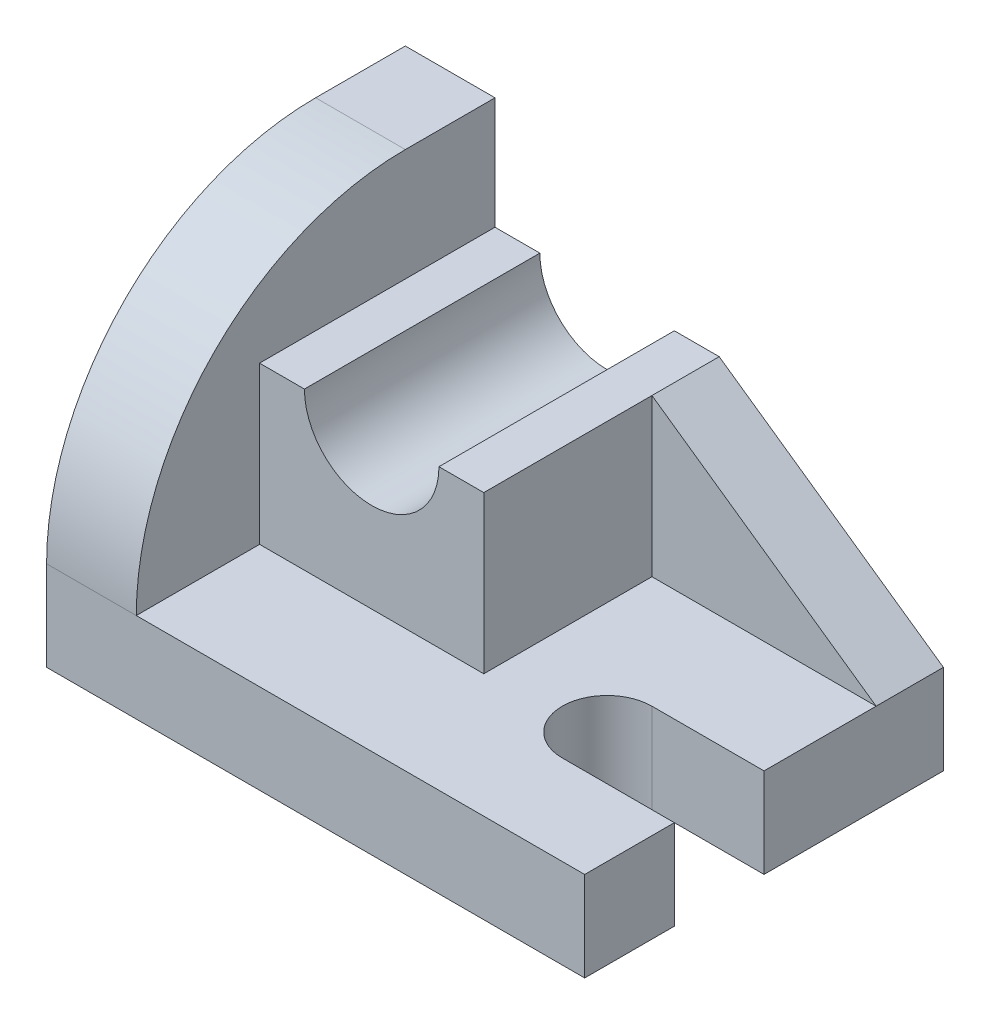
ISO-10303-21;
HEADER;
FILE_DESCRIPTION(('STEP AP214'),'2;1');
FILE_NAME('part.step','',(''),(''),'','','');
FILE_SCHEMA(('AUTOMOTIVE_DESIGN { 1 0 10303 214 1 1 1 1 }'));
ENDSEC;
DATA;
#1=APPLICATION_CONTEXT('core data for automotive mechanical design processes');
#2=APPLICATION_PROTOCOL_DEFINITION('international standard','automotive_design',2000,#1);
#3=PRODUCT_CONTEXT('',#1,'mechanical');
#4=PRODUCT('Part','Part','',(#3));
#5=PRODUCT_RELATED_PRODUCT_CATEGORY('part','',(#4));
#6=PRODUCT_DEFINITION_FORMATION('','',#4);
#7=PRODUCT_DEFINITION_CONTEXT('part definition',#1,'design');
#8=PRODUCT_DEFINITION('design','',#6,#7);
#9=PRODUCT_DEFINITION_SHAPE('','',#8);
#10=(LENGTH_UNIT() NAMED_UNIT(*) SI_UNIT(.MILLI.,.METRE.));
#11=(NAMED_UNIT(*) PLANE_ANGLE_UNIT() SI_UNIT($,.RADIAN.));
#12=(NAMED_UNIT(*) SI_UNIT($,.STERADIAN.) SOLID_ANGLE_UNIT());
#13=UNCERTAINTY_MEASURE_WITH_UNIT(LENGTH_MEASURE(1.E-05),#10,'distance_accuracy_value','');
#14=(GEOMETRIC_REPRESENTATION_CONTEXT(3) GLOBAL_UNCERTAINTY_ASSIGNED_CONTEXT((#13)) GLOBAL_UNIT_ASSIGNED_CONTEXT((#10,
#11,#12)) REPRESENTATION_CONTEXT('',''));
#15=CARTESIAN_POINT('',(0.,0.,0.));
#16=DIRECTION('',(0.,0.,1.));
#17=DIRECTION('',(1.,0.,0.));
#18=AXIS2_PLACEMENT_3D('',#15,#16,#17);
#19=CARTESIAN_POINT('',(0.,44.,0.));
#20=DIRECTION('',(0.,1.,0.));
#21=DIRECTION('',(0.,0.,1.));
#22=AXIS2_PLACEMENT_3D('',#19,#20,#21);
#23=PLANE('',#22);
#24=DIRECTION('',(0.,0.,1.));
#25=VECTOR('',#24,1.);
#26=CARTESIAN_POINT('',(24.,44.,-64.001));
#27=LINE('',#26,#25);
#28=CARTESIAN_POINT('',(24.,44.,-22.));
#29=VERTEX_POINT('',#28);
#30=CARTESIAN_POINT('',(24.,44.,-64.));
#31=VERTEX_POINT('',#30);
#32=EDGE_CURVE('E366',#29,#31,#27,.F.);
#33=ORIENTED_EDGE('',*,*,#32,.T.);
#34=DIRECTION('',(-1.,0.,0.));
#35=VECTOR('',#34,1.);
#36=CARTESIAN_POINT('',(16.,44.,-64.));
#37=LINE('',#36,#35);
#38=CARTESIAN_POINT('',(16.,44.,-64.));
#39=VERTEX_POINT('',#38);
#40=EDGE_CURVE('E194',#31,#39,#37,.T.);
#41=ORIENTED_EDGE('',*,*,#40,.T.);
#42=DIRECTION('',(0.,0.,1.));
#43=VECTOR('',#42,1.);
#44=CARTESIAN_POINT('',(16.,44.,-64.));
#45=LINE('',#44,#43);
#46=CARTESIAN_POINT('',(16.,44.,-22.));
#47=VERTEX_POINT('',#46);
#48=EDGE_CURVE('E213',#39,#47,#45,.T.);
#49=ORIENTED_EDGE('',*,*,#48,.T.);
#50=DIRECTION('',(1.,0.,0.));
#51=VECTOR('',#50,1.);
#52=CARTESIAN_POINT('',(16.,44.,-22.));
#53=LINE('',#52,#51);
#54=EDGE_CURVE('E195',#47,#29,#53,.T.);
#55=ORIENTED_EDGE('',*,*,#54,.T.);
#56=EDGE_LOOP('',(#33,#41,#49,#55));
#57=FACE_BOUND('',#56,.T.);
#58=ADVANCED_FACE('F43',(#57),#23,.T.);
#59=CARTESIAN_POINT('',(0.,16.,0.));
#60=DIRECTION('',(0.,-1.,0.));
#61=DIRECTION('',(0.,0.,-1.));
#62=AXIS2_PLACEMENT_3D('',#59,#60,#61);
#63=PLANE('',#62);
#64=DIRECTION('',(0.,0.,-1.));
#65=VECTOR('',#64,1.);
#66=CARTESIAN_POINT('',(96.,16.,0.));
#67=LINE('',#66,#65);
#68=CARTESIAN_POINT('',(96.,16.,-32.));
#69=VERTEX_POINT('',#68);
#70=CARTESIAN_POINT('',(96.,16.,-52.));
#71=VERTEX_POINT('',#70);
#72=EDGE_CURVE('E291',#69,#71,#67,.T.);
#73=ORIENTED_EDGE('',*,*,#72,.T.);
#74=DIRECTION('',(-1.,0.,0.));
#75=VECTOR('',#74,1.);
#76=CARTESIAN_POINT('',(56.,16.,-52.));
#77=LINE('',#76,#75);
#78=CARTESIAN_POINT('',(56.,16.,-52.));
#79=VERTEX_POINT('',#78);
#80=EDGE_CURVE('E173',#71,#79,#77,.T.);
#81=ORIENTED_EDGE('',*,*,#80,.T.);
#82=DIRECTION('',(0.,0.,-1.));
#83=VECTOR('',#82,1.);
#84=CARTESIAN_POINT('',(56.,16.,-64.));
#85=LINE('',#84,#83);
#86=CARTESIAN_POINT('',(56.,16.,-22.));
#87=VERTEX_POINT('',#86);
#88=EDGE_CURVE('E67',#87,#79,#85,.T.);
#89=ORIENTED_EDGE('',*,*,#88,.F.);
#90=DIRECTION('',(1.,0.,0.));
#91=VECTOR('',#90,1.);
#92=CARTESIAN_POINT('',(16.,16.,-22.));
#93=LINE('',#92,#91);
#94=CARTESIAN_POINT('',(16.,16.,-22.));
#95=VERTEX_POINT('',#94);
#96=EDGE_CURVE('E207',#95,#87,#93,.T.);
#97=ORIENTED_EDGE('',*,*,#96,.F.);
#98=DIRECTION('',(0.,0.,1.));
#99=VECTOR('',#98,1.);
#100=CARTESIAN_POINT('',(16.,16.,0.));
#101=LINE('',#100,#99);
#102=CARTESIAN_POINT('',(16.,16.,0.));
#103=VERTEX_POINT('',#102);
#104=EDGE_CURVE('E245',#95,#103,#101,.T.);
#105=ORIENTED_EDGE('',*,*,#104,.T.);
#106=DIRECTION('',(1.,0.,0.));
#107=VECTOR('',#106,1.);
#108=CARTESIAN_POINT('',(0.,16.,0.));
#109=LINE('',#108,#107);
#110=CARTESIAN_POINT('',(96.,16.,0.));
#111=VERTEX_POINT('',#110);
#112=EDGE_CURVE('E292',#103,#111,#109,.T.);
#113=ORIENTED_EDGE('',*,*,#112,.T.);
#114=CARTESIAN_POINT('',(96.,16.,-16.));
#115=VERTEX_POINT('',#114);
#116=EDGE_CURVE('E293',#111,#115,#67,.T.);
#117=ORIENTED_EDGE('',*,*,#116,.T.);
#118=DIRECTION('',(1.,0.,0.));
#119=VECTOR('',#118,1.);
#120=CARTESIAN_POINT('',(96.,16.,-16.));
#121=LINE('',#120,#119);
#122=CARTESIAN_POINT('',(76.,16.,-16.));
#123=VERTEX_POINT('',#122);
#124=EDGE_CURVE('E256',#123,#115,#121,.T.);
#125=ORIENTED_EDGE('',*,*,#124,.F.);
#126=CARTESIAN_POINT('',(76.,16.,-24.));
#127=DIRECTION('',(0.,1.,0.));
#128=DIRECTION('',(0.,0.,1.));
#129=AXIS2_PLACEMENT_3D('',#126,#127,#128);
#130=CIRCLE('',#129,7.99999999999999);
#131=CARTESIAN_POINT('',(76.,16.,-32.));
#132=VERTEX_POINT('',#131);
#133=EDGE_CURVE('E268',#132,#123,#130,.T.);
#134=ORIENTED_EDGE('',*,*,#133,.F.);
#135=DIRECTION('',(-1.,0.,0.));
#136=VECTOR('',#135,1.);
#137=CARTESIAN_POINT('',(96.,16.,-32.));
#138=LINE('',#137,#136);
#139=EDGE_CURVE('E250',#69,#132,#138,.T.);
#140=ORIENTED_EDGE('',*,*,#139,.F.);
#141=EDGE_LOOP('',(#73,#81,#89,#97,#105,#113,#117,#125,#134,#140));
#142=FACE_BOUND('',#141,.T.);
#143=ADVANCED_FACE('F335',(#142),#63,.F.);
#144=CARTESIAN_POINT('',(16.,16.,-48.));
#145=DIRECTION('',(1.,0.,0.));
#146=DIRECTION('',(0.,0.,-1.));
#147=AXIS2_PLACEMENT_3D('',#144,#145,#146);
#148=PLANE('',#147);
#149=ORIENTED_EDGE('',*,*,#104,.F.);
#150=DIRECTION('',(0.,-1.,0.));
#151=VECTOR('',#150,1.);
#152=CARTESIAN_POINT('',(16.,44.,-22.));
#153=LINE('',#152,#151);
#154=EDGE_CURVE('E216',#47,#95,#153,.T.);
#155=ORIENTED_EDGE('',*,*,#154,.F.);
#156=ORIENTED_EDGE('',*,*,#48,.F.);
#157=DIRECTION('',(0.,-1.,0.));
#158=VECTOR('',#157,1.);
#159=CARTESIAN_POINT('',(16.,0.,-64.));
#160=LINE('',#159,#158);
#161=CARTESIAN_POINT('',(16.,64.,-64.));
#162=VERTEX_POINT('',#161);
#163=EDGE_CURVE('E221',#162,#39,#160,.T.);
#164=ORIENTED_EDGE('',*,*,#163,.F.);
#165=DIRECTION('',(0.,0.,-1.));
#166=VECTOR('',#165,1.);
#167=CARTESIAN_POINT('',(16.,64.,-64.));
#168=LINE('',#167,#166);
#169=CARTESIAN_POINT('',(16.,64.,-48.0000000000003));
#170=VERTEX_POINT('',#169);
#171=EDGE_CURVE('E230',#170,#162,#168,.T.);
#172=ORIENTED_EDGE('',*,*,#171,.F.);
#173=CARTESIAN_POINT('',(16.,16.,-48.));
#174=DIRECTION('',(-1.,0.,0.));
#175=DIRECTION('',(0.,0.,-1.));
#176=AXIS2_PLACEMENT_3D('',#173,#174,#175);
#177=CIRCLE('',#176,48.);
#178=EDGE_CURVE('E225',#103,#170,#177,.T.);
#179=ORIENTED_EDGE('',*,*,#178,.F.);
#180=EDGE_LOOP('',(#149,#155,#156,#164,#172,#179));
#181=FACE_BOUND('',#180,.T.);
#182=ADVANCED_FACE('F360',(#181),#148,.T.);
#183=CARTESIAN_POINT('',(96.,16.,0.));
#184=DIRECTION('',(-1.,0.,0.));
#185=DIRECTION('',(0.,0.,1.));
#186=AXIS2_PLACEMENT_3D('',#183,#184,#185);
#187=PLANE('',#186);
#188=DIRECTION('',(0.,0.,-1.));
#189=VECTOR('',#188,1.);
#190=CARTESIAN_POINT('',(96.,0.,0.));
#191=LINE('',#190,#189);
#192=CARTESIAN_POINT('',(96.,0.,0.));
#193=VERTEX_POINT('',#192);
#194=CARTESIAN_POINT('',(96.,0.,-16.));
#195=VERTEX_POINT('',#194);
#196=EDGE_CURVE('E305',#193,#195,#191,.T.);
#197=ORIENTED_EDGE('',*,*,#196,.T.);
#198=DIRECTION('',(0.,1.,0.));
#199=VECTOR('',#198,1.);
#200=CARTESIAN_POINT('',(96.,0.,-16.));
#201=LINE('',#200,#199);
#202=EDGE_CURVE('E274',#195,#115,#201,.T.);
#203=ORIENTED_EDGE('',*,*,#202,.T.);
#204=ORIENTED_EDGE('',*,*,#116,.F.);
#205=DIRECTION('',(0.,-1.,0.));
#206=VECTOR('',#205,1.);
#207=CARTESIAN_POINT('',(96.,16.,0.));
#208=LINE('',#207,#206);
#209=EDGE_CURVE('E52',#111,#193,#208,.T.);
#210=ORIENTED_EDGE('',*,*,#209,.T.);
#211=EDGE_LOOP('',(#197,#203,#204,#210));
#212=FACE_BOUND('',#211,.T.);
#213=ADVANCED_FACE('F324',(#212),#187,.F.);
#214=CARTESIAN_POINT('',(0.,16.,0.));
#215=DIRECTION('',(1.,0.,0.));
#216=DIRECTION('',(0.,0.,-1.));
#217=AXIS2_PLACEMENT_3D('',#214,#215,#216);
#218=PLANE('',#217);
#219=DIRECTION('',(0.,0.,1.));
#220=VECTOR('',#219,1.);
#221=CARTESIAN_POINT('',(0.,0.,0.));
#222=LINE('',#221,#220);
#223=CARTESIAN_POINT('',(0.,0.,-64.));
#224=VERTEX_POINT('',#223);
#225=CARTESIAN_POINT('',(0.,0.,0.));
#226=VERTEX_POINT('',#225);
#227=EDGE_CURVE('E278',#224,#226,#222,.T.);
#228=ORIENTED_EDGE('',*,*,#227,.T.);
#229=DIRECTION('',(0.,-1.,0.));
#230=VECTOR('',#229,1.);
#231=CARTESIAN_POINT('',(0.,16.,0.));
#232=LINE('',#231,#230);
#233=CARTESIAN_POINT('',(0.,15.9999999999997,0.));
#234=VERTEX_POINT('',#233);
#235=EDGE_CURVE('E11',#234,#226,#232,.T.);
#236=ORIENTED_EDGE('',*,*,#235,.F.);
#237=CARTESIAN_POINT('',(0.,16.,-48.));
#238=DIRECTION('',(-1.,0.,0.));
#239=DIRECTION('',(0.,0.,-1.));
#240=AXIS2_PLACEMENT_3D('',#237,#238,#239);
#241=CIRCLE('',#240,48.);
#242=CARTESIAN_POINT('',(0.,64.,-48.0000000000003));
#243=VERTEX_POINT('',#242);
#244=EDGE_CURVE('E220',#234,#243,#241,.T.);
#245=ORIENTED_EDGE('',*,*,#244,.T.);
#246=DIRECTION('',(0.,0.,-1.));
#247=VECTOR('',#246,1.);
#248=CARTESIAN_POINT('',(0.,64.,-64.));
#249=LINE('',#248,#247);
#250=CARTESIAN_POINT('',(0.,64.,-64.));
#251=VERTEX_POINT('',#250);
#252=EDGE_CURVE('E226',#243,#251,#249,.T.);
#253=ORIENTED_EDGE('',*,*,#252,.T.);
#254=DIRECTION('',(0.,-1.,0.));
#255=VECTOR('',#254,1.);
#256=CARTESIAN_POINT('',(0.,16.,-64.));
#257=LINE('',#256,#255);
#258=EDGE_CURVE('E297',#251,#224,#257,.T.);
#259=ORIENTED_EDGE('',*,*,#258,.T.);
#260=EDGE_LOOP('',(#228,#236,#245,#253,#259));
#261=FACE_BOUND('',#260,.T.);
#262=ADVANCED_FACE('F45',(#261),#218,.F.);
#263=CARTESIAN_POINT('',(0.,16.,0.));
#264=DIRECTION('',(0.,0.,-1.));
#265=DIRECTION('',(-1.,0.,0.));
#266=AXIS2_PLACEMENT_3D('',#263,#264,#265);
#267=PLANE('',#266);
#268=ORIENTED_EDGE('',*,*,#112,.F.);
#269=EDGE_CURVE('E287',#234,#103,#109,.T.);
#270=ORIENTED_EDGE('',*,*,#269,.F.);
#271=ORIENTED_EDGE('',*,*,#235,.T.);
#272=DIRECTION('',(1.,0.,0.));
#273=VECTOR('',#272,1.);
#274=CARTESIAN_POINT('',(0.,0.,0.));
#275=LINE('',#274,#273);
#276=EDGE_CURVE('E301',#226,#193,#275,.T.);
#277=ORIENTED_EDGE('',*,*,#276,.T.);
#278=ORIENTED_EDGE('',*,*,#209,.F.);
#279=EDGE_LOOP('',(#268,#270,#271,#277,#278));
#280=FACE_BOUND('',#279,.T.);
#281=ADVANCED_FACE('F517',(#280),#267,.F.);
#282=ORIENTED_EDGE('',*,*,#72,.F.);
#283=DIRECTION('',(0.,1.,0.));
#284=VECTOR('',#283,1.);
#285=CARTESIAN_POINT('',(96.,0.,-32.));
#286=LINE('',#285,#284);
#287=CARTESIAN_POINT('',(96.,0.,-32.));
#288=VERTEX_POINT('',#287);
#289=EDGE_CURVE('E264',#288,#69,#286,.T.);
#290=ORIENTED_EDGE('',*,*,#289,.F.);
#291=CARTESIAN_POINT('',(96.,0.,-64.));
#292=VERTEX_POINT('',#291);
#293=EDGE_CURVE('E304',#288,#292,#191,.T.);
#294=ORIENTED_EDGE('',*,*,#293,.T.);
#295=DIRECTION('',(0.,-1.,0.));
#296=VECTOR('',#295,1.);
#297=CARTESIAN_POINT('',(96.,16.,-64.));
#298=LINE('',#297,#296);
#299=CARTESIAN_POINT('',(96.,16.,-64.));
#300=VERTEX_POINT('',#299);
#301=EDGE_CURVE('E315',#300,#292,#298,.T.);
#302=ORIENTED_EDGE('',*,*,#301,.F.);
#303=DIRECTION('',(0.,0.,-1.));
#304=VECTOR('',#303,1.);
#305=CARTESIAN_POINT('',(96.,16.,-52.));
#306=LINE('',#305,#304);
#307=EDGE_CURVE('E172',#71,#300,#306,.T.);
#308=ORIENTED_EDGE('',*,*,#307,.F.);
#309=EDGE_LOOP('',(#282,#290,#294,#302,#308));
#310=FACE_BOUND('',#309,.T.);
#311=ADVANCED_FACE('F347',(#310),#187,.F.);
#312=CARTESIAN_POINT('',(0.,16.,-64.));
#313=DIRECTION('',(0.,0.,1.));
#314=DIRECTION('',(1.,0.,0.));
#315=AXIS2_PLACEMENT_3D('',#312,#313,#314);
#316=PLANE('',#315);
#317=ORIENTED_EDGE('',*,*,#40,.F.);
#318=CARTESIAN_POINT('',(36.,44.,-64.));
#319=DIRECTION('',(0.,0.,1.));
#320=DIRECTION('',(1.,0.,0.));
#321=AXIS2_PLACEMENT_3D('',#318,#319,#320);
#322=CIRCLE('',#321,12.);
#323=CARTESIAN_POINT('',(48.,44.,-64.));
#324=VERTEX_POINT('',#323);
#325=EDGE_CURVE('E210',#324,#31,#322,.F.);
#326=ORIENTED_EDGE('',*,*,#325,.F.);
#327=CARTESIAN_POINT('',(56.,44.,-64.));
#328=VERTEX_POINT('',#327);
#329=EDGE_CURVE('E199',#328,#324,#37,.T.);
#330=ORIENTED_EDGE('',*,*,#329,.F.);
#331=DIRECTION('',(0.81923192051904,-0.573462344363329,0.));
#332=VECTOR('',#331,1.);
#333=CARTESIAN_POINT('',(56.,44.,-64.));
#334=LINE('',#333,#332);
#335=EDGE_CURVE('E166',#328,#300,#334,.T.);
#336=ORIENTED_EDGE('',*,*,#335,.T.);
#337=ORIENTED_EDGE('',*,*,#301,.T.);
#338=DIRECTION('',(-1.,0.,0.));
#339=VECTOR('',#338,1.);
#340=CARTESIAN_POINT('',(0.,0.,-64.));
#341=LINE('',#340,#339);
#342=EDGE_CURVE('E309',#292,#224,#341,.T.);
#343=ORIENTED_EDGE('',*,*,#342,.T.);
#344=ORIENTED_EDGE('',*,*,#258,.F.);
#345=DIRECTION('',(-1.,0.,0.));
#346=VECTOR('',#345,1.);
#347=CARTESIAN_POINT('',(16.,64.,-64.));
#348=LINE('',#347,#346);
#349=EDGE_CURVE('E241',#162,#251,#348,.T.);
#350=ORIENTED_EDGE('',*,*,#349,.F.);
#351=ORIENTED_EDGE('',*,*,#163,.T.);
#352=EDGE_LOOP('',(#317,#326,#330,#336,#337,#343,#344,#350,#351));
#353=FACE_BOUND('',#352,.T.);
#354=ADVANCED_FACE('F351',(#353),#316,.F.);
#355=CARTESIAN_POINT('',(0.,0.,0.));
#356=DIRECTION('',(0.,-1.,0.));
#357=DIRECTION('',(0.,0.,-1.));
#358=AXIS2_PLACEMENT_3D('',#355,#356,#357);
#359=PLANE('',#358);
#360=ORIENTED_EDGE('',*,*,#196,.F.);
#361=ORIENTED_EDGE('',*,*,#276,.F.);
#362=ORIENTED_EDGE('',*,*,#227,.F.);
#363=ORIENTED_EDGE('',*,*,#342,.F.);
#364=ORIENTED_EDGE('',*,*,#293,.F.);
#365=DIRECTION('',(-1.,0.,0.));
#366=VECTOR('',#365,1.);
#367=CARTESIAN_POINT('',(96.,0.,-32.));
#368=LINE('',#367,#366);
#369=CARTESIAN_POINT('',(76.,0.,-32.));
#370=VERTEX_POINT('',#369);
#371=EDGE_CURVE('E251',#288,#370,#368,.T.);
#372=ORIENTED_EDGE('',*,*,#371,.T.);
#373=CARTESIAN_POINT('',(76.,0.,-24.));
#374=DIRECTION('',(0.,1.,0.));
#375=DIRECTION('',(0.,0.,1.));
#376=AXIS2_PLACEMENT_3D('',#373,#374,#375);
#377=CIRCLE('',#376,7.99999999999999);
#378=CARTESIAN_POINT('',(76.,0.,-16.));
#379=VERTEX_POINT('',#378);
#380=EDGE_CURVE('E255',#370,#379,#377,.T.);
#381=ORIENTED_EDGE('',*,*,#380,.T.);
#382=DIRECTION('',(1.,0.,0.));
#383=VECTOR('',#382,1.);
#384=CARTESIAN_POINT('',(96.,0.,-16.));
#385=LINE('',#384,#383);
#386=EDGE_CURVE('E260',#379,#195,#385,.T.);
#387=ORIENTED_EDGE('',*,*,#386,.T.);
#388=EDGE_LOOP('',(#360,#361,#362,#363,#364,#372,#381,#387));
#389=FACE_BOUND('',#388,.T.);
#390=ADVANCED_FACE('F328',(#389),#359,.T.);
#391=CARTESIAN_POINT('',(96.,0.,-16.));
#392=DIRECTION('',(0.,0.,1.));
#393=DIRECTION('',(1.,0.,0.));
#394=AXIS2_PLACEMENT_3D('',#391,#392,#393);
#395=PLANE('',#394);
#396=ORIENTED_EDGE('',*,*,#124,.T.);
#397=ORIENTED_EDGE('',*,*,#202,.F.);
#398=ORIENTED_EDGE('',*,*,#386,.F.);
#399=DIRECTION('',(0.,1.,0.));
#400=VECTOR('',#399,1.);
#401=CARTESIAN_POINT('',(76.,0.,-16.));
#402=LINE('',#401,#400);
#403=EDGE_CURVE('E279',#379,#123,#402,.T.);
#404=ORIENTED_EDGE('',*,*,#403,.T.);
#405=EDGE_LOOP('',(#396,#397,#398,#404));
#406=FACE_BOUND('',#405,.T.);
#407=ADVANCED_FACE('F332',(#406),#395,.F.);
#408=CARTESIAN_POINT('',(76.,0.,-24.));
#409=DIRECTION('',(0.,1.,0.));
#410=DIRECTION('',(0.,0.,1.));
#411=AXIS2_PLACEMENT_3D('',#408,#409,#410);
#412=CYLINDRICAL_SURFACE('',#411,7.99999999999999);
#413=ORIENTED_EDGE('',*,*,#133,.T.);
#414=ORIENTED_EDGE('',*,*,#403,.F.);
#415=ORIENTED_EDGE('',*,*,#380,.F.);
#416=DIRECTION('',(0.,1.,0.));
#417=VECTOR('',#416,1.);
#418=CARTESIAN_POINT('',(76.,0.,-32.));
#419=LINE('',#418,#417);
#420=EDGE_CURVE('E282',#370,#132,#419,.T.);
#421=ORIENTED_EDGE('',*,*,#420,.T.);
#422=EDGE_LOOP('',(#413,#414,#415,#421));
#423=FACE_BOUND('',#422,.T.);
#424=ADVANCED_FACE('F488',(#423),#412,.F.);
#425=CARTESIAN_POINT('',(96.,0.,-32.));
#426=DIRECTION('',(0.,0.,-1.));
#427=DIRECTION('',(-1.,0.,0.));
#428=AXIS2_PLACEMENT_3D('',#425,#426,#427);
#429=PLANE('',#428);
#430=ORIENTED_EDGE('',*,*,#139,.T.);
#431=ORIENTED_EDGE('',*,*,#420,.F.);
#432=ORIENTED_EDGE('',*,*,#371,.F.);
#433=ORIENTED_EDGE('',*,*,#289,.T.);
#434=EDGE_LOOP('',(#430,#431,#432,#433));
#435=FACE_BOUND('',#434,.T.);
#436=ADVANCED_FACE('F480',(#435),#429,.F.);
#437=CARTESIAN_POINT('',(16.,64.,-64.));
#438=DIRECTION('',(0.,1.,0.));
#439=DIRECTION('',(0.,0.,1.));
#440=AXIS2_PLACEMENT_3D('',#437,#438,#439);
#441=PLANE('',#440);
#442=ORIENTED_EDGE('',*,*,#252,.F.);
#443=DIRECTION('',(-1.,0.,0.));
#444=VECTOR('',#443,1.);
#445=CARTESIAN_POINT('',(16.,64.,-48.0000000000003));
#446=LINE('',#445,#444);
#447=EDGE_CURVE('E234',#170,#243,#446,.T.);
#448=ORIENTED_EDGE('',*,*,#447,.F.);
#449=ORIENTED_EDGE('',*,*,#171,.T.);
#450=ORIENTED_EDGE('',*,*,#349,.T.);
#451=EDGE_LOOP('',(#442,#448,#449,#450));
#452=FACE_BOUND('',#451,.T.);
#453=ADVANCED_FACE('F356',(#452),#441,.T.);
#454=CARTESIAN_POINT('',(16.,16.,-48.));
#455=DIRECTION('',(-1.,0.,0.));
#456=DIRECTION('',(0.,0.,1.));
#457=AXIS2_PLACEMENT_3D('',#454,#455,#456);
#458=CYLINDRICAL_SURFACE('',#457,48.);
#459=ORIENTED_EDGE('',*,*,#244,.F.);
#460=ORIENTED_EDGE('',*,*,#269,.T.);
#461=ORIENTED_EDGE('',*,*,#178,.T.);
#462=ORIENTED_EDGE('',*,*,#447,.T.);
#463=EDGE_LOOP('',(#459,#460,#461,#462));
#464=FACE_BOUND('',#463,.T.);
#465=ADVANCED_FACE('F383',(#464),#458,.T.);
#466=CARTESIAN_POINT('',(16.,44.,-22.));
#467=DIRECTION('',(0.,0.,-1.));
#468=DIRECTION('',(-1.,0.,0.));
#469=AXIS2_PLACEMENT_3D('',#466,#467,#468);
#470=PLANE('',#469);
#471=CARTESIAN_POINT('',(48.,44.,-22.));
#472=VERTEX_POINT('',#471);
#473=CARTESIAN_POINT('',(56.,44.,-22.));
#474=VERTEX_POINT('',#473);
#475=EDGE_CURVE('E191',#472,#474,#53,.T.);
#476=ORIENTED_EDGE('',*,*,#475,.F.);
#477=CARTESIAN_POINT('',(36.,44.,-22.));
#478=DIRECTION('',(0.,0.,1.));
#479=DIRECTION('',(1.,0.,0.));
#480=AXIS2_PLACEMENT_3D('',#477,#478,#479);
#481=CIRCLE('',#480,12.);
#482=EDGE_CURVE('E59',#29,#472,#481,.T.);
#483=ORIENTED_EDGE('',*,*,#482,.F.);
#484=ORIENTED_EDGE('',*,*,#54,.F.);
#485=ORIENTED_EDGE('',*,*,#154,.T.);
#486=ORIENTED_EDGE('',*,*,#96,.T.);
#487=DIRECTION('',(0.,-1.,0.));
#488=VECTOR('',#487,1.);
#489=CARTESIAN_POINT('',(56.,44.,-22.));
#490=LINE('',#489,#488);
#491=EDGE_CURVE('E206',#474,#87,#490,.T.);
#492=ORIENTED_EDGE('',*,*,#491,.F.);
#493=EDGE_LOOP('',(#476,#483,#484,#485,#486,#492));
#494=FACE_BOUND('',#493,.T.);
#495=ADVANCED_FACE('F381',(#494),#470,.F.);
#496=CARTESIAN_POINT('',(56.,44.,-64.));
#497=DIRECTION('',(-1.,0.,0.));
#498=DIRECTION('',(0.,0.,1.));
#499=AXIS2_PLACEMENT_3D('',#496,#497,#498);
#500=PLANE('',#499);
#501=ORIENTED_EDGE('',*,*,#88,.T.);
#502=DIRECTION('',(0.,1.,0.));
#503=VECTOR('',#502,1.);
#504=CARTESIAN_POINT('',(56.,44.,-52.));
#505=LINE('',#504,#503);
#506=CARTESIAN_POINT('',(56.,44.,-52.));
#507=VERTEX_POINT('',#506);
#508=EDGE_CURVE('E178',#79,#507,#505,.T.);
#509=ORIENTED_EDGE('',*,*,#508,.T.);
#510=DIRECTION('',(0.,0.,-1.));
#511=VECTOR('',#510,1.);
#512=CARTESIAN_POINT('',(56.,44.,-64.));
#513=LINE('',#512,#511);
#514=EDGE_CURVE('E186',#474,#507,#513,.T.);
#515=ORIENTED_EDGE('',*,*,#514,.F.);
#516=ORIENTED_EDGE('',*,*,#491,.T.);
#517=EDGE_LOOP('',(#501,#509,#515,#516));
#518=FACE_BOUND('',#517,.T.);
#519=ADVANCED_FACE('F184',(#518),#500,.F.);
#520=DIRECTION('',(0.,0.,1.));
#521=VECTOR('',#520,1.);
#522=CARTESIAN_POINT('',(48.,44.,-64.001));
#523=LINE('',#522,#521);
#524=EDGE_CURVE('E369',#324,#472,#523,.T.);
#525=ORIENTED_EDGE('',*,*,#524,.T.);
#526=ORIENTED_EDGE('',*,*,#475,.T.);
#527=ORIENTED_EDGE('',*,*,#514,.T.);
#528=DIRECTION('',(0.,0.,-1.));
#529=VECTOR('',#528,1.);
#530=CARTESIAN_POINT('',(56.,44.,-52.));
#531=LINE('',#530,#529);
#532=EDGE_CURVE('E160',#507,#328,#531,.T.);
#533=ORIENTED_EDGE('',*,*,#532,.T.);
#534=ORIENTED_EDGE('',*,*,#329,.T.);
#535=EDGE_LOOP('',(#525,#526,#527,#533,#534));
#536=FACE_BOUND('',#535,.T.);
#537=ADVANCED_FACE('F189',(#536),#23,.T.);
#538=CARTESIAN_POINT('',(36.,44.,-64.001));
#539=DIRECTION('',(0.,0.,1.));
#540=DIRECTION('',(1.,0.,0.));
#541=AXIS2_PLACEMENT_3D('',#538,#539,#540);
#542=CYLINDRICAL_SURFACE('',#541,12.);
#543=ORIENTED_EDGE('',*,*,#482,.T.);
#544=ORIENTED_EDGE('',*,*,#524,.F.);
#545=ORIENTED_EDGE('',*,*,#325,.T.);
#546=ORIENTED_EDGE('',*,*,#32,.F.);
#547=EDGE_LOOP('',(#543,#544,#545,#546));
#548=FACE_BOUND('',#547,.T.);
#549=ADVANCED_FACE('F379',(#548),#542,.F.);
#550=CARTESIAN_POINT('',(56.,44.,-52.));
#551=DIRECTION('',(0.573462344363328,0.81923192051904,0.));
#552=DIRECTION('',(-0.81923192051904,0.573462344363329,0.));
#553=AXIS2_PLACEMENT_3D('',#550,#551,#552);
#554=PLANE('',#553);
#555=ORIENTED_EDGE('',*,*,#335,.F.);
#556=ORIENTED_EDGE('',*,*,#532,.F.);
#557=DIRECTION('',(0.81923192051904,-0.573462344363329,0.));
#558=VECTOR('',#557,1.);
#559=CARTESIAN_POINT('',(56.,44.,-52.));
#560=LINE('',#559,#558);
#561=EDGE_CURVE('E163',#507,#71,#560,.T.);
#562=ORIENTED_EDGE('',*,*,#561,.T.);
#563=ORIENTED_EDGE('',*,*,#307,.T.);
#564=EDGE_LOOP('',(#555,#556,#562,#563));
#565=FACE_BOUND('',#564,.T.);
#566=ADVANCED_FACE('F162',(#565),#554,.T.);
#567=CARTESIAN_POINT('',(0.,0.,-52.));
#568=DIRECTION('',(0.,0.,1.));
#569=DIRECTION('',(1.,0.,0.));
#570=AXIS2_PLACEMENT_3D('',#567,#568,#569);
#571=PLANE('',#570);
#572=ORIENTED_EDGE('',*,*,#508,.F.);
#573=ORIENTED_EDGE('',*,*,#80,.F.);
#574=ORIENTED_EDGE('',*,*,#561,.F.);
#575=EDGE_LOOP('',(#572,#573,#574));
#576=FACE_BOUND('',#575,.T.);
#577=ADVANCED_FACE('F177',(#576),#571,.T.);
#578=CLOSED_SHELL('',(#58,#143,#182,#213,#262,#281,#311,#354,#390,#407,#424,#436,#453,#465,#495,
#519,#537,#549,#566,#577));
#579=MANIFOLD_SOLID_BREP('B2',#578);
#580=ADVANCED_BREP_SHAPE_REPRESENTATION('',(#18,#579),#14);
#581=SHAPE_DEFINITION_REPRESENTATION(#9,#580);
ENDSEC;
END-ISO-10303-21;
